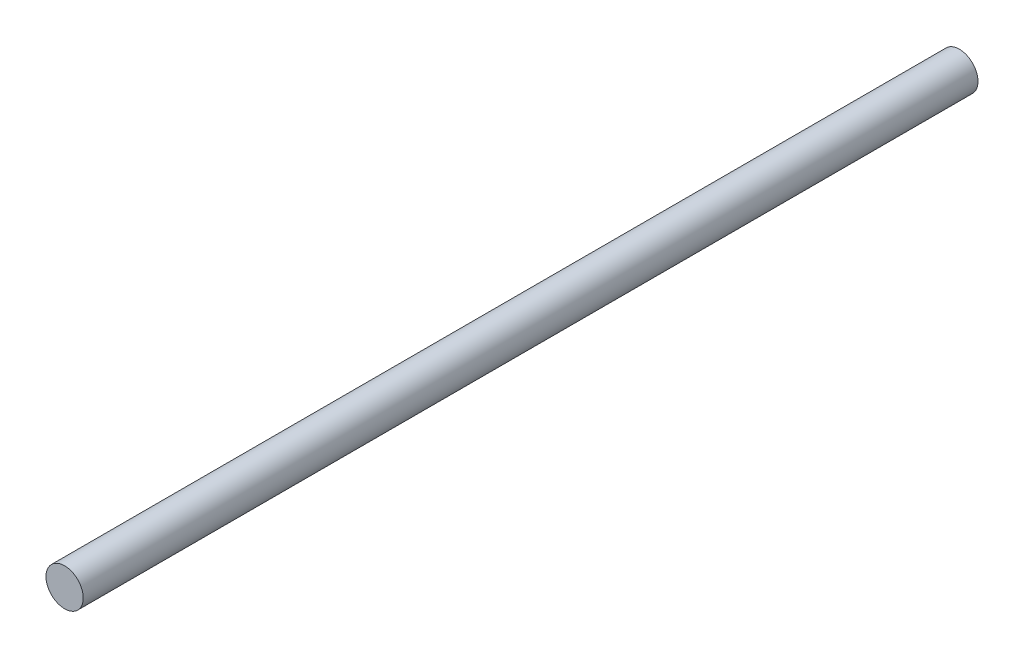
ISO-10303-21;
HEADER;
FILE_DESCRIPTION(('STEP AP214'),'2;1');
FILE_NAME('part.step','',(''),(''),'','','');
FILE_SCHEMA(('AUTOMOTIVE_DESIGN { 1 0 10303 214 1 1 1 1 }'));
ENDSEC;
DATA;
#1=APPLICATION_CONTEXT('core data for automotive mechanical design processes');
#2=APPLICATION_PROTOCOL_DEFINITION('international standard','automotive_design',2000,#1);
#3=PRODUCT_CONTEXT('',#1,'mechanical');
#4=PRODUCT('Part','Part','',(#3));
#5=PRODUCT_RELATED_PRODUCT_CATEGORY('part','',(#4));
#6=PRODUCT_DEFINITION_FORMATION('','',#4);
#7=PRODUCT_DEFINITION_CONTEXT('part definition',#1,'design');
#8=PRODUCT_DEFINITION('design','',#6,#7);
#9=PRODUCT_DEFINITION_SHAPE('','',#8);
#10=(LENGTH_UNIT() NAMED_UNIT(*) SI_UNIT(.MILLI.,.METRE.));
#11=(NAMED_UNIT(*) PLANE_ANGLE_UNIT() SI_UNIT($,.RADIAN.));
#12=(NAMED_UNIT(*) SI_UNIT($,.STERADIAN.) SOLID_ANGLE_UNIT());
#13=UNCERTAINTY_MEASURE_WITH_UNIT(LENGTH_MEASURE(1.E-05),#10,'distance_accuracy_value','');
#14=(GEOMETRIC_REPRESENTATION_CONTEXT(3) GLOBAL_UNCERTAINTY_ASSIGNED_CONTEXT((#13)) GLOBAL_UNIT_ASSIGNED_CONTEXT((#10,
#11,#12)) REPRESENTATION_CONTEXT('',''));
#15=CARTESIAN_POINT('',(0.,0.,0.));
#16=DIRECTION('',(0.,0.,1.));
#17=DIRECTION('',(1.,0.,0.));
#18=AXIS2_PLACEMENT_3D('',#15,#16,#17);
#19=CARTESIAN_POINT('',(0.,0.,152.4));
#20=DIRECTION('',(0.,0.,-1.));
#21=DIRECTION('',(-1.,0.,0.));
#22=AXIS2_PLACEMENT_3D('',#19,#20,#21);
#23=CYLINDRICAL_SURFACE('',#22,3.175);
#24=CARTESIAN_POINT('',(0.,0.,152.4));
#25=DIRECTION('',(0.,0.,1.));
#26=DIRECTION('',(1.,0.,0.));
#27=AXIS2_PLACEMENT_3D('',#24,#25,#26);
#28=CIRCLE('',#27,3.175);
#29=CARTESIAN_POINT('',(3.175,0.,152.4));
#30=VERTEX_POINT('',#29);
#31=EDGE_CURVE('E10',#30,#30,#28,.T.);
#32=ORIENTED_EDGE('',*,*,#31,.F.);
#33=EDGE_LOOP('',(#32));
#34=FACE_BOUND('',#33,.T.);
#35=CARTESIAN_POINT('',(0.,0.,0.));
#36=DIRECTION('',(0.,0.,1.));
#37=DIRECTION('',(1.,0.,0.));
#38=AXIS2_PLACEMENT_3D('',#35,#36,#37);
#39=CIRCLE('',#38,3.175);
#40=CARTESIAN_POINT('',(3.175,0.,0.));
#41=VERTEX_POINT('',#40);
#42=EDGE_CURVE('E38',#41,#41,#39,.T.);
#43=ORIENTED_EDGE('',*,*,#42,.T.);
#44=EDGE_LOOP('',(#43));
#45=FACE_BOUND('',#44,.T.);
#46=ADVANCED_FACE('F35',(#34,#45),#23,.T.);
#47=CARTESIAN_POINT('',(0.,0.,152.4));
#48=DIRECTION('',(0.,0.,1.));
#49=DIRECTION('',(1.,0.,0.));
#50=AXIS2_PLACEMENT_3D('',#47,#48,#49);
#51=PLANE('',#50);
#52=ORIENTED_EDGE('',*,*,#31,.T.);
#53=EDGE_LOOP('',(#52));
#54=FACE_BOUND('',#53,.T.);
#55=ADVANCED_FACE('F50',(#54),#51,.T.);
#56=CARTESIAN_POINT('',(0.,0.,0.));
#57=DIRECTION('',(0.,0.,1.));
#58=DIRECTION('',(1.,0.,0.));
#59=AXIS2_PLACEMENT_3D('',#56,#57,#58);
#60=PLANE('',#59);
#61=ORIENTED_EDGE('',*,*,#42,.F.);
#62=EDGE_LOOP('',(#61));
#63=FACE_BOUND('',#62,.T.);
#64=ADVANCED_FACE('F48',(#63),#60,.F.);
#65=CLOSED_SHELL('',(#46,#55,#64));
#66=MANIFOLD_SOLID_BREP('B2',#65);
#67=ADVANCED_BREP_SHAPE_REPRESENTATION('',(#18,#66),#14);
#68=SHAPE_DEFINITION_REPRESENTATION(#9,#67);
ENDSEC;
END-ISO-10303-21;
